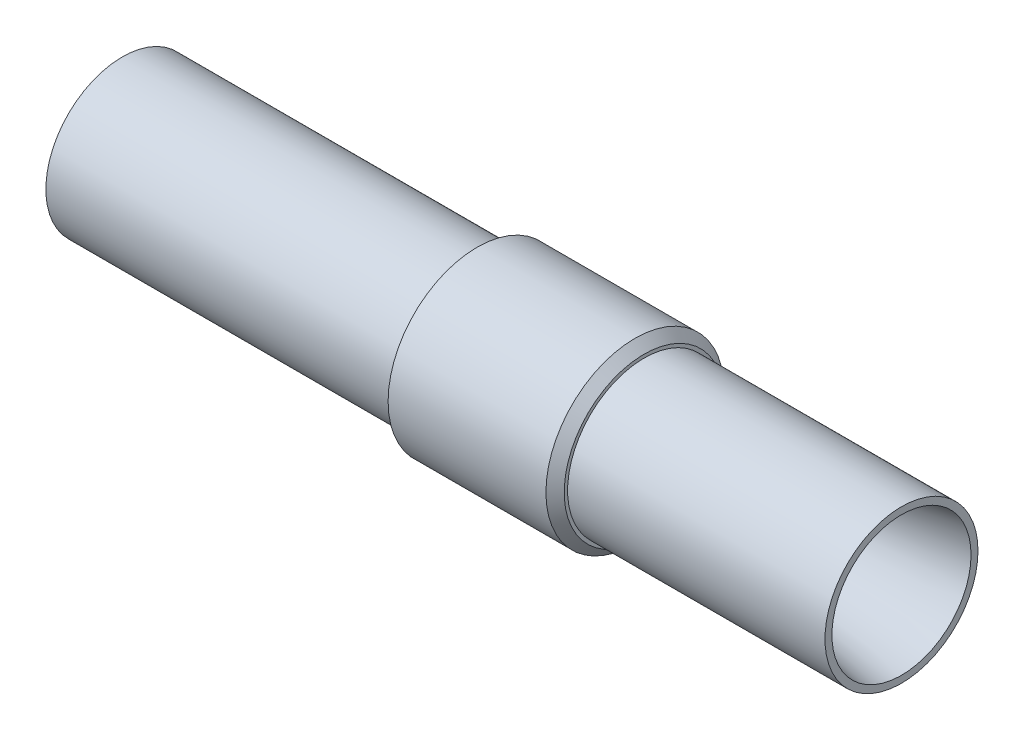
ISO-10303-21;
HEADER;
FILE_DESCRIPTION(('STEP AP214'),'2;1');
FILE_NAME('part.step','',(''),(''),'','','');
FILE_SCHEMA(('AUTOMOTIVE_DESIGN { 1 0 10303 214 1 1 1 1 }'));
ENDSEC;
DATA;
#1=APPLICATION_CONTEXT('core data for automotive mechanical design processes');
#2=APPLICATION_PROTOCOL_DEFINITION('international standard','automotive_design',2000,#1);
#3=PRODUCT_CONTEXT('',#1,'mechanical');
#4=PRODUCT('Part','Part','',(#3));
#5=PRODUCT_RELATED_PRODUCT_CATEGORY('part','',(#4));
#6=PRODUCT_DEFINITION_FORMATION('','',#4);
#7=PRODUCT_DEFINITION_CONTEXT('part definition',#1,'design');
#8=PRODUCT_DEFINITION('design','',#6,#7);
#9=PRODUCT_DEFINITION_SHAPE('','',#8);
#10=(LENGTH_UNIT() NAMED_UNIT(*) SI_UNIT(.MILLI.,.METRE.));
#11=(NAMED_UNIT(*) PLANE_ANGLE_UNIT() SI_UNIT($,.RADIAN.));
#12=(NAMED_UNIT(*) SI_UNIT($,.STERADIAN.) SOLID_ANGLE_UNIT());
#13=UNCERTAINTY_MEASURE_WITH_UNIT(LENGTH_MEASURE(1.E-05),#10,'distance_accuracy_value','');
#14=(GEOMETRIC_REPRESENTATION_CONTEXT(3) GLOBAL_UNCERTAINTY_ASSIGNED_CONTEXT((#13)) GLOBAL_UNIT_ASSIGNED_CONTEXT((#10,
#11,#12)) REPRESENTATION_CONTEXT('',''));
#15=CARTESIAN_POINT('',(0.,0.,0.));
#16=DIRECTION('',(0.,0.,1.));
#17=DIRECTION('',(1.,0.,0.));
#18=AXIS2_PLACEMENT_3D('',#15,#16,#17);
#19=CARTESIAN_POINT('',(0.,0.,0.));
#20=DIRECTION('',(1.,0.,0.));
#21=DIRECTION('',(0.,0.,-1.));
#22=AXIS2_PLACEMENT_3D('',#19,#20,#21);
#23=CYLINDRICAL_SURFACE('',#22,27.5);
#24=CARTESIAN_POINT('',(-280.,0.,0.));
#25=DIRECTION('',(1.,0.,0.));
#26=DIRECTION('',(0.,0.,-1.));
#27=AXIS2_PLACEMENT_3D('',#24,#25,#26);
#28=CIRCLE('',#27,27.5);
#29=CARTESIAN_POINT('',(-280.,0.,-27.5));
#30=VERTEX_POINT('',#29);
#31=EDGE_CURVE('E65',#30,#30,#28,.T.);
#32=ORIENTED_EDGE('',*,*,#31,.T.);
#33=EDGE_LOOP('',(#32));
#34=FACE_BOUND('',#33,.T.);
#35=CARTESIAN_POINT('',(-152.5,0.,0.));
#36=DIRECTION('',(1.,0.,0.));
#37=DIRECTION('',(0.,0.,-1.));
#38=AXIS2_PLACEMENT_3D('',#35,#36,#37);
#39=CIRCLE('',#38,27.5);
#40=CARTESIAN_POINT('',(-152.5,0.,-27.5));
#41=VERTEX_POINT('',#40);
#42=EDGE_CURVE('E74',#41,#41,#39,.T.);
#43=ORIENTED_EDGE('',*,*,#42,.F.);
#44=EDGE_LOOP('',(#43));
#45=FACE_BOUND('',#44,.T.);
#46=ADVANCED_FACE('F36',(#34,#45),#23,.T.);
#47=CARTESIAN_POINT('',(0.,27.5,0.));
#48=DIRECTION('',(1.,0.,0.));
#49=DIRECTION('',(0.,0.,-1.));
#50=AXIS2_PLACEMENT_3D('',#47,#48,#49);
#51=PLANE('',#50);
#52=CARTESIAN_POINT('',(0.,0.,0.));
#53=DIRECTION('',(1.,0.,0.));
#54=DIRECTION('',(0.,0.,-1.));
#55=AXIS2_PLACEMENT_3D('',#52,#53,#54);
#56=CIRCLE('',#55,27.5);
#57=CARTESIAN_POINT('',(0.,0.,-27.5));
#58=VERTEX_POINT('',#57);
#59=EDGE_CURVE('E68',#58,#58,#56,.T.);
#60=ORIENTED_EDGE('',*,*,#59,.T.);
#61=EDGE_LOOP('',(#60));
#62=FACE_BOUND('',#61,.T.);
#63=CARTESIAN_POINT('',(0.,0.,0.));
#64=DIRECTION('',(1.,0.,0.));
#65=DIRECTION('',(0.,0.,-1.));
#66=AXIS2_PLACEMENT_3D('',#63,#64,#65);
#67=CIRCLE('',#66,25.);
#68=CARTESIAN_POINT('',(0.,0.,-25.));
#69=VERTEX_POINT('',#68);
#70=EDGE_CURVE('E51',#69,#69,#67,.T.);
#71=ORIENTED_EDGE('',*,*,#70,.F.);
#72=EDGE_LOOP('',(#71));
#73=FACE_BOUND('',#72,.T.);
#74=ADVANCED_FACE('F81',(#62,#73),#51,.T.);
#75=CARTESIAN_POINT('',(-77.5,0.,0.));
#76=DIRECTION('',(1.,0.,0.));
#77=DIRECTION('',(0.,0.,-1.));
#78=AXIS2_PLACEMENT_3D('',#75,#76,#77);
#79=CONICAL_SURFACE('',#78,12.5,0.159913123158219);
#80=ORIENTED_EDGE('',*,*,#70,.T.);
#81=EDGE_LOOP('',(#80));
#82=FACE_BOUND('',#81,.T.);
#83=CARTESIAN_POINT('',(-77.5,0.,0.));
#84=DIRECTION('',(1.,0.,0.));
#85=DIRECTION('',(0.,0.,-1.));
#86=AXIS2_PLACEMENT_3D('',#83,#84,#85);
#87=CIRCLE('',#86,12.5);
#88=CARTESIAN_POINT('',(-77.5,0.,-12.5));
#89=VERTEX_POINT('',#88);
#90=EDGE_CURVE('E56',#89,#89,#87,.T.);
#91=ORIENTED_EDGE('',*,*,#90,.F.);
#92=EDGE_LOOP('',(#91));
#93=FACE_BOUND('',#92,.T.);
#94=ADVANCED_FACE('F88',(#82,#93),#79,.F.);
#95=CARTESIAN_POINT('',(0.,0.,0.));
#96=DIRECTION('',(1.,0.,0.));
#97=DIRECTION('',(0.,0.,-1.));
#98=AXIS2_PLACEMENT_3D('',#95,#96,#97);
#99=CYLINDRICAL_SURFACE('',#98,12.5);
#100=ORIENTED_EDGE('',*,*,#90,.T.);
#101=EDGE_LOOP('',(#100));
#102=FACE_BOUND('',#101,.T.);
#103=CARTESIAN_POINT('',(-145.,0.,0.));
#104=DIRECTION('',(1.,0.,0.));
#105=DIRECTION('',(0.,0.,-1.));
#106=AXIS2_PLACEMENT_3D('',#103,#104,#105);
#107=CIRCLE('',#106,12.5);
#108=CARTESIAN_POINT('',(-145.,0.,-12.5));
#109=VERTEX_POINT('',#108);
#110=EDGE_CURVE('E59',#109,#109,#107,.T.);
#111=ORIENTED_EDGE('',*,*,#110,.F.);
#112=EDGE_LOOP('',(#111));
#113=FACE_BOUND('',#112,.T.);
#114=ADVANCED_FACE('F111',(#102,#113),#99,.F.);
#115=CARTESIAN_POINT('',(-280.,0.,0.));
#116=DIRECTION('',(-1.,0.,0.));
#117=DIRECTION('',(0.,0.,1.));
#118=AXIS2_PLACEMENT_3D('',#115,#116,#117);
#119=CONICAL_SURFACE('',#118,25.,0.0923293347315989);
#120=ORIENTED_EDGE('',*,*,#110,.T.);
#121=EDGE_LOOP('',(#120));
#122=FACE_BOUND('',#121,.T.);
#123=CARTESIAN_POINT('',(-280.,0.,0.));
#124=DIRECTION('',(1.,0.,0.));
#125=DIRECTION('',(0.,0.,-1.));
#126=AXIS2_PLACEMENT_3D('',#123,#124,#125);
#127=CIRCLE('',#126,25.);
#128=CARTESIAN_POINT('',(-280.,0.,-25.));
#129=VERTEX_POINT('',#128);
#130=EDGE_CURVE('E62',#129,#129,#127,.T.);
#131=ORIENTED_EDGE('',*,*,#130,.F.);
#132=EDGE_LOOP('',(#131));
#133=FACE_BOUND('',#132,.T.);
#134=ADVANCED_FACE('F101',(#122,#133),#119,.F.);
#135=CARTESIAN_POINT('',(-280.,27.5,0.));
#136=DIRECTION('',(-1.,0.,0.));
#137=DIRECTION('',(0.,0.,1.));
#138=AXIS2_PLACEMENT_3D('',#135,#136,#137);
#139=PLANE('',#138);
#140=ORIENTED_EDGE('',*,*,#130,.T.);
#141=EDGE_LOOP('',(#140));
#142=FACE_BOUND('',#141,.T.);
#143=ORIENTED_EDGE('',*,*,#31,.F.);
#144=EDGE_LOOP('',(#143));
#145=FACE_BOUND('',#144,.T.);
#146=ADVANCED_FACE('F94',(#142,#145),#139,.T.);
#147=CARTESIAN_POINT('',(-92.5,0.,0.));
#148=DIRECTION('',(1.,0.,0.));
#149=DIRECTION('',(0.,0.,-1.));
#150=AXIS2_PLACEMENT_3D('',#147,#148,#149);
#151=CIRCLE('',#150,27.5);
#152=CARTESIAN_POINT('',(-92.5,0.,-27.5));
#153=VERTEX_POINT('',#152);
#154=EDGE_CURVE('E47',#153,#153,#151,.F.);
#155=ORIENTED_EDGE('',*,*,#154,.F.);
#156=EDGE_LOOP('',(#155));
#157=FACE_BOUND('',#156,.T.);
#158=ORIENTED_EDGE('',*,*,#59,.F.);
#159=EDGE_LOOP('',(#158));
#160=FACE_BOUND('',#159,.T.);
#161=ADVANCED_FACE('F84',(#157,#160),#23,.T.);
#162=CARTESIAN_POINT('',(-92.5,0.,0.));
#163=DIRECTION('',(1.,0.,0.));
#164=DIRECTION('',(0.,0.,-1.));
#165=AXIS2_PLACEMENT_3D('',#162,#163,#164);
#166=PLANE('',#165);
#167=CARTESIAN_POINT('',(-92.5,0.,0.));
#168=DIRECTION('',(1.,0.,0.));
#169=DIRECTION('',(0.,0.,-1.));
#170=AXIS2_PLACEMENT_3D('',#167,#168,#169);
#171=CIRCLE('',#170,28.7125000000001);
#172=CARTESIAN_POINT('',(-92.5,0.,-28.7125000000001));
#173=VERTEX_POINT('',#172);
#174=EDGE_CURVE('E43',#173,#173,#171,.T.);
#175=ORIENTED_EDGE('',*,*,#174,.T.);
#176=EDGE_LOOP('',(#175));
#177=FACE_BOUND('',#176,.T.);
#178=ORIENTED_EDGE('',*,*,#154,.T.);
#179=EDGE_LOOP('',(#178));
#180=FACE_BOUND('',#179,.T.);
#181=ADVANCED_FACE('F93',(#177,#180),#166,.T.);
#182=CARTESIAN_POINT('',(-152.5,0.,0.));
#183=DIRECTION('',(1.,0.,0.));
#184=DIRECTION('',(0.,0.,-1.));
#185=AXIS2_PLACEMENT_3D('',#182,#183,#184);
#186=PLANE('',#185);
#187=CARTESIAN_POINT('',(-152.5,0.,0.));
#188=DIRECTION('',(1.,0.,0.));
#189=DIRECTION('',(0.,0.,-1.));
#190=AXIS2_PLACEMENT_3D('',#187,#188,#189);
#191=CIRCLE('',#190,32.);
#192=CARTESIAN_POINT('',(-152.5,0.,-32.));
#193=VERTEX_POINT('',#192);
#194=EDGE_CURVE('E71',#193,#193,#191,.T.);
#195=ORIENTED_EDGE('',*,*,#194,.F.);
#196=EDGE_LOOP('',(#195));
#197=FACE_BOUND('',#196,.T.);
#198=ORIENTED_EDGE('',*,*,#42,.T.);
#199=EDGE_LOOP('',(#198));
#200=FACE_BOUND('',#199,.T.);
#201=ADVANCED_FACE('F78',(#197,#200),#186,.F.);
#202=CARTESIAN_POINT('',(-92.5,0.,0.));
#203=DIRECTION('',(-1.,0.,0.));
#204=DIRECTION('',(0.,0.,1.));
#205=AXIS2_PLACEMENT_3D('',#202,#203,#204);
#206=CYLINDRICAL_SURFACE('',#205,32.);
#207=CARTESIAN_POINT('',(-95.7875,0.,0.));
#208=DIRECTION('',(1.,0.,0.));
#209=DIRECTION('',(0.,0.,-1.));
#210=AXIS2_PLACEMENT_3D('',#207,#208,#209);
#211=CIRCLE('',#210,32.);
#212=CARTESIAN_POINT('',(-95.7875,0.,-32.));
#213=VERTEX_POINT('',#212);
#214=EDGE_CURVE('E10',#213,#213,#211,.F.);
#215=ORIENTED_EDGE('',*,*,#214,.T.);
#216=EDGE_LOOP('',(#215));
#217=FACE_BOUND('',#216,.T.);
#218=ORIENTED_EDGE('',*,*,#194,.T.);
#219=EDGE_LOOP('',(#218));
#220=FACE_BOUND('',#219,.T.);
#221=ADVANCED_FACE('F149',(#217,#220),#206,.T.);
#222=CARTESIAN_POINT('',(-92.5,0.,0.));
#223=DIRECTION('',(-1.,0.,0.));
#224=DIRECTION('',(0.,0.,1.));
#225=AXIS2_PLACEMENT_3D('',#222,#223,#224);
#226=CONICAL_SURFACE('',#225,28.7125000000001,0.785398163397444);
#227=ORIENTED_EDGE('',*,*,#214,.F.);
#228=EDGE_LOOP('',(#227));
#229=FACE_BOUND('',#228,.T.);
#230=ORIENTED_EDGE('',*,*,#174,.F.);
#231=EDGE_LOOP('',(#230));
#232=FACE_BOUND('',#231,.T.);
#233=ADVANCED_FACE('F38',(#229,#232),#226,.T.);
#234=CLOSED_SHELL('',(#46,#74,#94,#114,#134,#146,#161,#181,#201,#221,#233));
#235=MANIFOLD_SOLID_BREP('B2',#234);
#236=ADVANCED_BREP_SHAPE_REPRESENTATION('',(#18,#235),#14);
#237=SHAPE_DEFINITION_REPRESENTATION(#9,#236);
ENDSEC;
END-ISO-10303-21;
